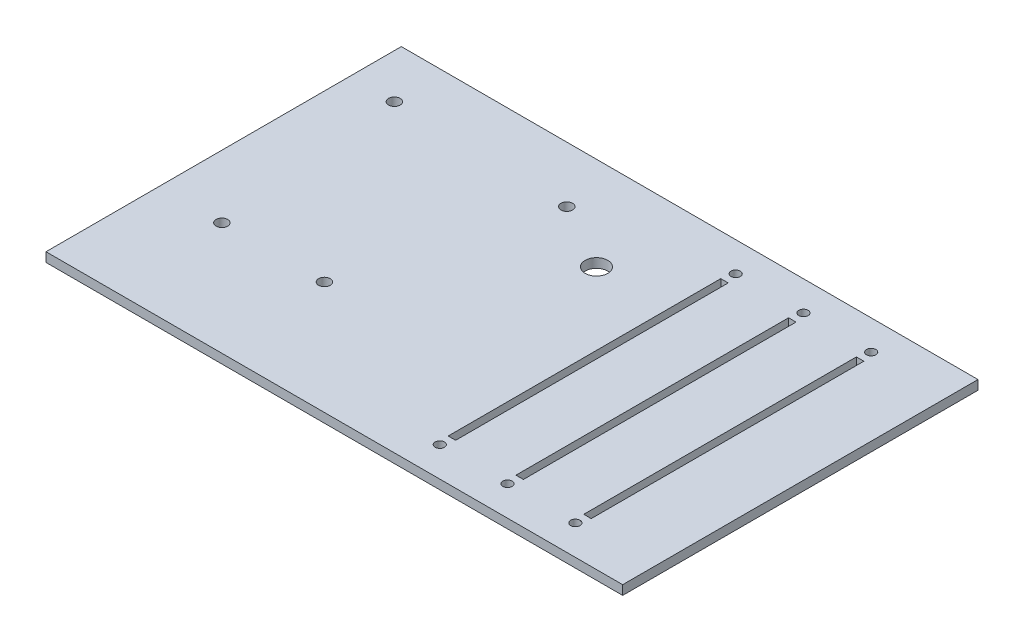
ISO-10303-21;
HEADER;
FILE_DESCRIPTION(('STEP AP214'),'2;1');
FILE_NAME('part.step','',(''),(''),'','','');
FILE_SCHEMA(('AUTOMOTIVE_DESIGN { 1 0 10303 214 1 1 1 1 }'));
ENDSEC;
DATA;
#1=APPLICATION_CONTEXT('core data for automotive mechanical design processes');
#2=APPLICATION_PROTOCOL_DEFINITION('international standard','automotive_design',2000,#1);
#3=PRODUCT_CONTEXT('',#1,'mechanical');
#4=PRODUCT('Part','Part','',(#3));
#5=PRODUCT_RELATED_PRODUCT_CATEGORY('part','',(#4));
#6=PRODUCT_DEFINITION_FORMATION('','',#4);
#7=PRODUCT_DEFINITION_CONTEXT('part definition',#1,'design');
#8=PRODUCT_DEFINITION('design','',#6,#7);
#9=PRODUCT_DEFINITION_SHAPE('','',#8);
#10=(LENGTH_UNIT() NAMED_UNIT(*) SI_UNIT(.MILLI.,.METRE.));
#11=(NAMED_UNIT(*) PLANE_ANGLE_UNIT() SI_UNIT($,.RADIAN.));
#12=(NAMED_UNIT(*) SI_UNIT($,.STERADIAN.) SOLID_ANGLE_UNIT());
#13=UNCERTAINTY_MEASURE_WITH_UNIT(LENGTH_MEASURE(1.E-05),#10,'distance_accuracy_value','');
#14=(GEOMETRIC_REPRESENTATION_CONTEXT(3) GLOBAL_UNCERTAINTY_ASSIGNED_CONTEXT((#13)) GLOBAL_UNIT_ASSIGNED_CONTEXT((#10,
#11,#12)) REPRESENTATION_CONTEXT('',''));
#15=CARTESIAN_POINT('',(0.,0.,0.));
#16=DIRECTION('',(0.,0.,1.));
#17=DIRECTION('',(1.,0.,0.));
#18=AXIS2_PLACEMENT_3D('',#15,#16,#17);
#19=CARTESIAN_POINT('',(0.,2.54,0.));
#20=DIRECTION('',(0.,-1.,0.));
#21=DIRECTION('',(0.,0.,-1.));
#22=AXIS2_PLACEMENT_3D('',#19,#20,#21);
#23=PLANE('',#22);
#24=DIRECTION('',(-1.,0.,0.));
#25=VECTOR('',#24,1.);
#26=CARTESIAN_POINT('',(38.19525,2.54,-37.17925));
#27=LINE('',#26,#25);
#28=CARTESIAN_POINT('',(40.22725,2.54,-37.17925));
#29=VERTEX_POINT('',#28);
#30=CARTESIAN_POINT('',(38.19525,2.54,-37.17925));
#31=VERTEX_POINT('',#30);
#32=EDGE_CURVE('E185',#29,#31,#27,.T.);
#33=ORIENTED_EDGE('',*,*,#32,.F.);
#34=DIRECTION('',(0.,0.,-1.));
#35=VECTOR('',#34,1.);
#36=CARTESIAN_POINT('',(40.22725,2.54,-37.17925));
#37=LINE('',#36,#35);
#38=CARTESIAN_POINT('',(40.22725,2.54,37.11575));
#39=VERTEX_POINT('',#38);
#40=EDGE_CURVE('E193',#39,#29,#37,.T.);
#41=ORIENTED_EDGE('',*,*,#40,.F.);
#42=DIRECTION('',(1.,0.,0.));
#43=VECTOR('',#42,1.);
#44=CARTESIAN_POINT('',(40.22725,2.54,37.11575));
#45=LINE('',#44,#43);
#46=CARTESIAN_POINT('',(38.19525,2.54,37.11575));
#47=VERTEX_POINT('',#46);
#48=EDGE_CURVE('E190',#47,#39,#45,.T.);
#49=ORIENTED_EDGE('',*,*,#48,.F.);
#50=DIRECTION('',(0.,0.,1.));
#51=VECTOR('',#50,1.);
#52=CARTESIAN_POINT('',(38.19525,2.54,37.11575));
#53=LINE('',#52,#51);
#54=EDGE_CURVE('E187',#31,#47,#53,.T.);
#55=ORIENTED_EDGE('',*,*,#54,.F.);
#56=EDGE_LOOP('',(#33,#41,#49,#55));
#57=FACE_BOUND('',#56,.T.);
#58=CARTESIAN_POINT('',(-18.25625,2.54,-33.17875));
#59=DIRECTION('',(0.,1.,0.));
#60=DIRECTION('',(0.,0.,1.));
#61=AXIS2_PLACEMENT_3D('',#58,#59,#60);
#62=CIRCLE('',#61,1.5875);
#63=CARTESIAN_POINT('',(-18.25625,2.54,-31.59125));
#64=VERTEX_POINT('',#63);
#65=EDGE_CURVE('E247',#64,#64,#62,.T.);
#66=ORIENTED_EDGE('',*,*,#65,.F.);
#67=EDGE_LOOP('',(#66));
#68=FACE_BOUND('',#67,.T.);
#69=CARTESIAN_POINT('',(-33.49625,2.54,17.62125));
#70=DIRECTION('',(0.,1.,0.));
#71=DIRECTION('',(0.,0.,1.));
#72=AXIS2_PLACEMENT_3D('',#69,#70,#71);
#73=CIRCLE('',#72,1.5875);
#74=CARTESIAN_POINT('',(-33.49625,2.54,19.20875));
#75=VERTEX_POINT('',#74);
#76=EDGE_CURVE('E253',#75,#75,#73,.T.);
#77=ORIENTED_EDGE('',*,*,#76,.F.);
#78=EDGE_LOOP('',(#77));
#79=FACE_BOUND('',#78,.T.);
#80=CARTESIAN_POINT('',(-61.43625,2.54,17.62125));
#81=DIRECTION('',(0.,1.,0.));
#82=DIRECTION('',(0.,0.,1.));
#83=AXIS2_PLACEMENT_3D('',#80,#81,#82);
#84=CIRCLE('',#83,1.5875);
#85=CARTESIAN_POINT('',(-61.43625,2.54,19.20875));
#86=VERTEX_POINT('',#85);
#87=EDGE_CURVE('E259',#86,#86,#84,.T.);
#88=ORIENTED_EDGE('',*,*,#87,.F.);
#89=EDGE_LOOP('',(#88));
#90=FACE_BOUND('',#89,.T.);
#91=CARTESIAN_POINT('',(-66.51625,2.54,-34.44875));
#92=DIRECTION('',(0.,1.,0.));
#93=DIRECTION('',(0.,0.,1.));
#94=AXIS2_PLACEMENT_3D('',#91,#92,#93);
#95=CIRCLE('',#94,1.5875);
#96=CARTESIAN_POINT('',(-66.51625,2.54,-32.86125));
#97=VERTEX_POINT('',#96);
#98=EDGE_CURVE('E265',#97,#97,#95,.T.);
#99=ORIENTED_EDGE('',*,*,#98,.F.);
#100=EDGE_LOOP('',(#99));
#101=FACE_BOUND('',#100,.T.);
#102=DIRECTION('',(0.,0.,-1.));
#103=VECTOR('',#102,1.);
#104=CARTESIAN_POINT('',(78.58125,2.54,48.41875));
#105=LINE('',#104,#103);
#106=CARTESIAN_POINT('',(78.58125,2.54,48.41875));
#107=VERTEX_POINT('',#106);
#108=CARTESIAN_POINT('',(78.58125,2.54,-48.41875));
#109=VERTEX_POINT('',#108);
#110=EDGE_CURVE('E271',#107,#109,#105,.T.);
#111=ORIENTED_EDGE('',*,*,#110,.T.);
#112=DIRECTION('',(-1.,0.,0.));
#113=VECTOR('',#112,1.);
#114=CARTESIAN_POINT('',(-78.58125,2.54,-48.41875));
#115=LINE('',#114,#113);
#116=CARTESIAN_POINT('',(-78.58125,2.54,-48.41875));
#117=VERTEX_POINT('',#116);
#118=EDGE_CURVE('E274',#109,#117,#115,.T.);
#119=ORIENTED_EDGE('',*,*,#118,.T.);
#120=DIRECTION('',(0.,0.,1.));
#121=VECTOR('',#120,1.);
#122=CARTESIAN_POINT('',(-78.58125,2.54,48.41875));
#123=LINE('',#122,#121);
#124=CARTESIAN_POINT('',(-78.58125,2.54,48.41875));
#125=VERTEX_POINT('',#124);
#126=EDGE_CURVE('E277',#117,#125,#123,.T.);
#127=ORIENTED_EDGE('',*,*,#126,.T.);
#128=DIRECTION('',(1.,0.,0.));
#129=VECTOR('',#128,1.);
#130=CARTESIAN_POINT('',(-78.58125,2.54,48.41875));
#131=LINE('',#130,#129);
#132=EDGE_CURVE('E279',#125,#107,#131,.T.);
#133=ORIENTED_EDGE('',*,*,#132,.T.);
#134=EDGE_LOOP('',(#111,#119,#127,#133));
#135=FACE_BOUND('',#134,.T.);
#136=DIRECTION('',(-1.,0.,0.));
#137=VECTOR('',#136,1.);
#138=CARTESIAN_POINT('',(19.7167499999999,2.54,-37.17925));
#139=LINE('',#138,#137);
#140=CARTESIAN_POINT('',(21.74875,2.54,-37.17925));
#141=VERTEX_POINT('',#140);
#142=CARTESIAN_POINT('',(19.7167499999999,2.54,-37.17925));
#143=VERTEX_POINT('',#142);
#144=EDGE_CURVE('E216',#141,#143,#139,.T.);
#145=ORIENTED_EDGE('',*,*,#144,.F.);
#146=DIRECTION('',(0.,0.,-1.));
#147=VECTOR('',#146,1.);
#148=CARTESIAN_POINT('',(21.74875,2.54,-37.17925));
#149=LINE('',#148,#147);
#150=CARTESIAN_POINT('',(21.74875,2.54,37.11575));
#151=VERTEX_POINT('',#150);
#152=EDGE_CURVE('E224',#151,#141,#149,.T.);
#153=ORIENTED_EDGE('',*,*,#152,.F.);
#154=DIRECTION('',(1.,0.,0.));
#155=VECTOR('',#154,1.);
#156=CARTESIAN_POINT('',(21.74875,2.54,37.11575));
#157=LINE('',#156,#155);
#158=CARTESIAN_POINT('',(19.7167499999999,2.54,37.11575));
#159=VERTEX_POINT('',#158);
#160=EDGE_CURVE('E221',#159,#151,#157,.T.);
#161=ORIENTED_EDGE('',*,*,#160,.F.);
#162=DIRECTION('',(0.,0.,1.));
#163=VECTOR('',#162,1.);
#164=CARTESIAN_POINT('',(19.7167499999999,2.54,37.11575));
#165=LINE('',#164,#163);
#166=EDGE_CURVE('E218',#143,#159,#165,.T.);
#167=ORIENTED_EDGE('',*,*,#166,.F.);
#168=EDGE_LOOP('',(#145,#153,#161,#167));
#169=FACE_BOUND('',#168,.T.);
#170=DIRECTION('',(-1.,0.,0.));
#171=VECTOR('',#170,1.);
#172=CARTESIAN_POINT('',(56.67375,2.54,-37.17925));
#173=LINE('',#172,#171);
#174=CARTESIAN_POINT('',(58.70575,2.54,-37.17925));
#175=VERTEX_POINT('',#174);
#176=CARTESIAN_POINT('',(56.67375,2.54,-37.17925));
#177=VERTEX_POINT('',#176);
#178=EDGE_CURVE('E146',#175,#177,#173,.T.);
#179=ORIENTED_EDGE('',*,*,#178,.F.);
#180=DIRECTION('',(0.,0.,-1.));
#181=VECTOR('',#180,1.);
#182=CARTESIAN_POINT('',(58.70575,2.54,-37.17925));
#183=LINE('',#182,#181);
#184=CARTESIAN_POINT('',(58.70575,2.54,37.11575));
#185=VERTEX_POINT('',#184);
#186=EDGE_CURVE('E169',#185,#175,#183,.T.);
#187=ORIENTED_EDGE('',*,*,#186,.F.);
#188=DIRECTION('',(1.,0.,0.));
#189=VECTOR('',#188,1.);
#190=CARTESIAN_POINT('',(58.70575,2.54,37.11575));
#191=LINE('',#190,#189);
#192=CARTESIAN_POINT('',(56.67375,2.54,37.11575));
#193=VERTEX_POINT('',#192);
#194=EDGE_CURVE('E167',#193,#185,#191,.T.);
#195=ORIENTED_EDGE('',*,*,#194,.F.);
#196=DIRECTION('',(0.,0.,1.));
#197=VECTOR('',#196,1.);
#198=CARTESIAN_POINT('',(56.67375,2.54,37.11575));
#199=LINE('',#198,#197);
#200=EDGE_CURVE('E154',#177,#193,#199,.T.);
#201=ORIENTED_EDGE('',*,*,#200,.F.);
#202=EDGE_LOOP('',(#179,#187,#195,#201));
#203=FACE_BOUND('',#202,.T.);
#204=CARTESIAN_POINT('',(57.56275,2.54,-40.32885));
#205=DIRECTION('',(0.,1.,0.));
#206=DIRECTION('',(0.,0.,1.));
#207=AXIS2_PLACEMENT_3D('',#204,#205,#206);
#208=CIRCLE('',#207,1.27);
#209=CARTESIAN_POINT('',(57.56275,2.54,-39.05885));
#210=VERTEX_POINT('',#209);
#211=EDGE_CURVE('E175',#210,#210,#208,.T.);
#212=ORIENTED_EDGE('',*,*,#211,.F.);
#213=EDGE_LOOP('',(#212));
#214=FACE_BOUND('',#213,.T.);
#215=CARTESIAN_POINT('',(39.08425,2.54,-40.35425));
#216=DIRECTION('',(0.,1.,0.));
#217=DIRECTION('',(0.,0.,1.));
#218=AXIS2_PLACEMENT_3D('',#215,#216,#217);
#219=CIRCLE('',#218,1.27);
#220=CARTESIAN_POINT('',(39.08425,2.54,-39.08425));
#221=VERTEX_POINT('',#220);
#222=EDGE_CURVE('E395',#221,#221,#219,.T.);
#223=ORIENTED_EDGE('',*,*,#222,.F.);
#224=EDGE_LOOP('',(#223));
#225=FACE_BOUND('',#224,.T.);
#226=CARTESIAN_POINT('',(20.6057499999999,2.54,-40.35425));
#227=DIRECTION('',(0.,1.,0.));
#228=DIRECTION('',(0.,0.,1.));
#229=AXIS2_PLACEMENT_3D('',#226,#227,#228);
#230=CIRCLE('',#229,1.27);
#231=CARTESIAN_POINT('',(20.6057499999999,2.54,-39.08425));
#232=VERTEX_POINT('',#231);
#233=EDGE_CURVE('E390',#232,#232,#230,.T.);
#234=ORIENTED_EDGE('',*,*,#233,.F.);
#235=EDGE_LOOP('',(#234));
#236=FACE_BOUND('',#235,.T.);
#237=CARTESIAN_POINT('',(57.56275,2.54,40.29075));
#238=DIRECTION('',(0.,1.,0.));
#239=DIRECTION('',(0.,0.,1.));
#240=AXIS2_PLACEMENT_3D('',#237,#238,#239);
#241=CIRCLE('',#240,1.27);
#242=CARTESIAN_POINT('',(57.56275,2.54,41.56075));
#243=VERTEX_POINT('',#242);
#244=EDGE_CURVE('E385',#243,#243,#241,.T.);
#245=ORIENTED_EDGE('',*,*,#244,.F.);
#246=EDGE_LOOP('',(#245));
#247=FACE_BOUND('',#246,.T.);
#248=CARTESIAN_POINT('',(39.08425,2.54,40.29075));
#249=DIRECTION('',(0.,1.,0.));
#250=DIRECTION('',(0.,0.,1.));
#251=AXIS2_PLACEMENT_3D('',#248,#249,#250);
#252=CIRCLE('',#251,1.27);
#253=CARTESIAN_POINT('',(39.08425,2.54,41.56075));
#254=VERTEX_POINT('',#253);
#255=EDGE_CURVE('E380',#254,#254,#252,.T.);
#256=ORIENTED_EDGE('',*,*,#255,.F.);
#257=EDGE_LOOP('',(#256));
#258=FACE_BOUND('',#257,.T.);
#259=CARTESIAN_POINT('',(20.6057499999999,2.54,40.29075));
#260=DIRECTION('',(0.,1.,0.));
#261=DIRECTION('',(0.,0.,1.));
#262=AXIS2_PLACEMENT_3D('',#259,#260,#261);
#263=CIRCLE('',#262,1.27);
#264=CARTESIAN_POINT('',(20.6057499999999,2.54,41.56075));
#265=VERTEX_POINT('',#264);
#266=EDGE_CURVE('E375',#265,#265,#263,.T.);
#267=ORIENTED_EDGE('',*,*,#266,.F.);
#268=EDGE_LOOP('',(#267));
#269=FACE_BOUND('',#268,.T.);
#270=CARTESIAN_POINT('',(0.,2.54,-23.01875));
#271=DIRECTION('',(0.,1.,0.));
#272=DIRECTION('',(0.,0.,1.));
#273=AXIS2_PLACEMENT_3D('',#270,#271,#272);
#274=CIRCLE('',#273,3.0861);
#275=CARTESIAN_POINT('',(0.,2.54,-19.93265));
#276=VERTEX_POINT('',#275);
#277=EDGE_CURVE('E369',#276,#276,#274,.T.);
#278=ORIENTED_EDGE('',*,*,#277,.F.);
#279=EDGE_LOOP('',(#278));
#280=FACE_BOUND('',#279,.T.);
#281=ADVANCED_FACE('F33',(#57,#68,#79,#90,#101,#135,#169,#203,#214,#225,#236,#247,#258,#269,
#280),#23,.F.);
#282=CARTESIAN_POINT('',(0.,0.,0.));
#283=DIRECTION('',(0.,-1.,0.));
#284=DIRECTION('',(0.,0.,-1.));
#285=AXIS2_PLACEMENT_3D('',#282,#283,#284);
#286=PLANE('',#285);
#287=CARTESIAN_POINT('',(20.6057499999999,0.,40.29075));
#288=DIRECTION('',(0.,1.,0.));
#289=DIRECTION('',(0.,0.,1.));
#290=AXIS2_PLACEMENT_3D('',#287,#288,#289);
#291=CIRCLE('',#290,1.27);
#292=CARTESIAN_POINT('',(20.6057499999999,0.,41.56075));
#293=VERTEX_POINT('',#292);
#294=EDGE_CURVE('E372',#293,#293,#291,.T.);
#295=ORIENTED_EDGE('',*,*,#294,.T.);
#296=EDGE_LOOP('',(#295));
#297=FACE_BOUND('',#296,.T.);
#298=CARTESIAN_POINT('',(57.56275,0.,40.29075));
#299=DIRECTION('',(0.,1.,0.));
#300=DIRECTION('',(0.,0.,1.));
#301=AXIS2_PLACEMENT_3D('',#298,#299,#300);
#302=CIRCLE('',#301,1.27);
#303=CARTESIAN_POINT('',(57.56275,0.,41.56075));
#304=VERTEX_POINT('',#303);
#305=EDGE_CURVE('E383',#304,#304,#302,.T.);
#306=ORIENTED_EDGE('',*,*,#305,.T.);
#307=EDGE_LOOP('',(#306));
#308=FACE_BOUND('',#307,.T.);
#309=CARTESIAN_POINT('',(39.08425,0.,-40.35425));
#310=DIRECTION('',(0.,1.,0.));
#311=DIRECTION('',(0.,0.,1.));
#312=AXIS2_PLACEMENT_3D('',#309,#310,#311);
#313=CIRCLE('',#312,1.27);
#314=CARTESIAN_POINT('',(39.08425,0.,-39.08425));
#315=VERTEX_POINT('',#314);
#316=EDGE_CURVE('E393',#315,#315,#313,.T.);
#317=ORIENTED_EDGE('',*,*,#316,.T.);
#318=EDGE_LOOP('',(#317));
#319=FACE_BOUND('',#318,.T.);
#320=DIRECTION('',(0.,0.,-1.));
#321=VECTOR('',#320,1.);
#322=CARTESIAN_POINT('',(58.70575,0.,-37.17925));
#323=LINE('',#322,#321);
#324=CARTESIAN_POINT('',(58.70575,0.,37.11575));
#325=VERTEX_POINT('',#324);
#326=CARTESIAN_POINT('',(58.70575,0.,-37.17925));
#327=VERTEX_POINT('',#326);
#328=EDGE_CURVE('E155',#325,#327,#323,.T.);
#329=ORIENTED_EDGE('',*,*,#328,.T.);
#330=DIRECTION('',(-1.,0.,0.));
#331=VECTOR('',#330,1.);
#332=CARTESIAN_POINT('',(56.67375,0.,-37.17925));
#333=LINE('',#332,#331);
#334=CARTESIAN_POINT('',(56.67375,0.,-37.17925));
#335=VERTEX_POINT('',#334);
#336=EDGE_CURVE('E56',#327,#335,#333,.T.);
#337=ORIENTED_EDGE('',*,*,#336,.T.);
#338=DIRECTION('',(0.,0.,1.));
#339=VECTOR('',#338,1.);
#340=CARTESIAN_POINT('',(56.67375,0.,37.11575));
#341=LINE('',#340,#339);
#342=CARTESIAN_POINT('',(56.67375,0.,37.11575));
#343=VERTEX_POINT('',#342);
#344=EDGE_CURVE('E161',#335,#343,#341,.T.);
#345=ORIENTED_EDGE('',*,*,#344,.T.);
#346=DIRECTION('',(1.,0.,0.));
#347=VECTOR('',#346,1.);
#348=CARTESIAN_POINT('',(58.70575,0.,37.11575));
#349=LINE('',#348,#347);
#350=EDGE_CURVE('E177',#343,#325,#349,.T.);
#351=ORIENTED_EDGE('',*,*,#350,.T.);
#352=EDGE_LOOP('',(#329,#337,#345,#351));
#353=FACE_BOUND('',#352,.T.);
#354=DIRECTION('',(0.,0.,-1.));
#355=VECTOR('',#354,1.);
#356=CARTESIAN_POINT('',(40.22725,0.,-37.17925));
#357=LINE('',#356,#355);
#358=CARTESIAN_POINT('',(40.22725,0.,37.11575));
#359=VERTEX_POINT('',#358);
#360=CARTESIAN_POINT('',(40.22725,0.,-37.17925));
#361=VERTEX_POINT('',#360);
#362=EDGE_CURVE('E188',#359,#361,#357,.T.);
#363=ORIENTED_EDGE('',*,*,#362,.T.);
#364=DIRECTION('',(-1.,0.,0.));
#365=VECTOR('',#364,1.);
#366=CARTESIAN_POINT('',(38.19525,0.,-37.17925));
#367=LINE('',#366,#365);
#368=CARTESIAN_POINT('',(38.19525,0.,-37.17925));
#369=VERTEX_POINT('',#368);
#370=EDGE_CURVE('E162',#361,#369,#367,.T.);
#371=ORIENTED_EDGE('',*,*,#370,.T.);
#372=DIRECTION('',(0.,0.,1.));
#373=VECTOR('',#372,1.);
#374=CARTESIAN_POINT('',(38.19525,0.,37.11575));
#375=LINE('',#374,#373);
#376=CARTESIAN_POINT('',(38.19525,0.,37.11575));
#377=VERTEX_POINT('',#376);
#378=EDGE_CURVE('E198',#369,#377,#375,.T.);
#379=ORIENTED_EDGE('',*,*,#378,.T.);
#380=DIRECTION('',(1.,0.,0.));
#381=VECTOR('',#380,1.);
#382=CARTESIAN_POINT('',(40.22725,0.,37.11575));
#383=LINE('',#382,#381);
#384=EDGE_CURVE('E201',#377,#359,#383,.T.);
#385=ORIENTED_EDGE('',*,*,#384,.T.);
#386=EDGE_LOOP('',(#363,#371,#379,#385));
#387=FACE_BOUND('',#386,.T.);
#388=DIRECTION('',(0.,0.,-1.));
#389=VECTOR('',#388,1.);
#390=CARTESIAN_POINT('',(21.74875,0.,-37.17925));
#391=LINE('',#390,#389);
#392=CARTESIAN_POINT('',(21.74875,0.,37.11575));
#393=VERTEX_POINT('',#392);
#394=CARTESIAN_POINT('',(21.74875,0.,-37.17925));
#395=VERTEX_POINT('',#394);
#396=EDGE_CURVE('E219',#393,#395,#391,.T.);
#397=ORIENTED_EDGE('',*,*,#396,.T.);
#398=DIRECTION('',(-1.,0.,0.));
#399=VECTOR('',#398,1.);
#400=CARTESIAN_POINT('',(19.7167499999999,0.,-37.17925));
#401=LINE('',#400,#399);
#402=CARTESIAN_POINT('',(19.7167499999999,0.,-37.17925));
#403=VERTEX_POINT('',#402);
#404=EDGE_CURVE('E215',#395,#403,#401,.T.);
#405=ORIENTED_EDGE('',*,*,#404,.T.);
#406=DIRECTION('',(0.,0.,1.));
#407=VECTOR('',#406,1.);
#408=CARTESIAN_POINT('',(19.7167499999999,0.,37.11575));
#409=LINE('',#408,#407);
#410=CARTESIAN_POINT('',(19.7167499999999,0.,37.11575));
#411=VERTEX_POINT('',#410);
#412=EDGE_CURVE('E229',#403,#411,#409,.T.);
#413=ORIENTED_EDGE('',*,*,#412,.T.);
#414=DIRECTION('',(1.,0.,0.));
#415=VECTOR('',#414,1.);
#416=CARTESIAN_POINT('',(21.74875,0.,37.11575));
#417=LINE('',#416,#415);
#418=EDGE_CURVE('E232',#411,#393,#417,.T.);
#419=ORIENTED_EDGE('',*,*,#418,.T.);
#420=EDGE_LOOP('',(#397,#405,#413,#419));
#421=FACE_BOUND('',#420,.T.);
#422=CARTESIAN_POINT('',(-18.25625,0.,-33.17875));
#423=DIRECTION('',(0.,1.,0.));
#424=DIRECTION('',(0.,0.,1.));
#425=AXIS2_PLACEMENT_3D('',#422,#423,#424);
#426=CIRCLE('',#425,1.5875);
#427=CARTESIAN_POINT('',(-18.25625,0.,-31.59125));
#428=VERTEX_POINT('',#427);
#429=EDGE_CURVE('E246',#428,#428,#426,.T.);
#430=ORIENTED_EDGE('',*,*,#429,.T.);
#431=EDGE_LOOP('',(#430));
#432=FACE_BOUND('',#431,.T.);
#433=CARTESIAN_POINT('',(-61.43625,0.,17.62125));
#434=DIRECTION('',(0.,1.,0.));
#435=DIRECTION('',(0.,0.,1.));
#436=AXIS2_PLACEMENT_3D('',#433,#434,#435);
#437=CIRCLE('',#436,1.5875);
#438=CARTESIAN_POINT('',(-61.43625,0.,19.20875));
#439=VERTEX_POINT('',#438);
#440=EDGE_CURVE('E256',#439,#439,#437,.T.);
#441=ORIENTED_EDGE('',*,*,#440,.T.);
#442=EDGE_LOOP('',(#441));
#443=FACE_BOUND('',#442,.T.);
#444=DIRECTION('',(0.,0.,-1.));
#445=VECTOR('',#444,1.);
#446=CARTESIAN_POINT('',(78.58125,0.,48.41875));
#447=LINE('',#446,#445);
#448=CARTESIAN_POINT('',(78.58125,0.,48.41875));
#449=VERTEX_POINT('',#448);
#450=CARTESIAN_POINT('',(78.58125,0.,-48.41875));
#451=VERTEX_POINT('',#450);
#452=EDGE_CURVE('E268',#449,#451,#447,.T.);
#453=ORIENTED_EDGE('',*,*,#452,.F.);
#454=DIRECTION('',(1.,0.,0.));
#455=VECTOR('',#454,1.);
#456=CARTESIAN_POINT('',(-78.58125,0.,48.41875));
#457=LINE('',#456,#455);
#458=CARTESIAN_POINT('',(-78.58125,0.,48.41875));
#459=VERTEX_POINT('',#458);
#460=EDGE_CURVE('E275',#459,#449,#457,.T.);
#461=ORIENTED_EDGE('',*,*,#460,.F.);
#462=DIRECTION('',(0.,0.,1.));
#463=VECTOR('',#462,1.);
#464=CARTESIAN_POINT('',(-78.58125,0.,48.41875));
#465=LINE('',#464,#463);
#466=CARTESIAN_POINT('',(-78.58125,0.,-48.41875));
#467=VERTEX_POINT('',#466);
#468=EDGE_CURVE('E286',#467,#459,#465,.T.);
#469=ORIENTED_EDGE('',*,*,#468,.F.);
#470=DIRECTION('',(-1.,0.,0.));
#471=VECTOR('',#470,1.);
#472=CARTESIAN_POINT('',(-78.58125,0.,-48.41875));
#473=LINE('',#472,#471);
#474=EDGE_CURVE('E284',#451,#467,#473,.T.);
#475=ORIENTED_EDGE('',*,*,#474,.F.);
#476=EDGE_LOOP('',(#453,#461,#469,#475));
#477=FACE_BOUND('',#476,.T.);
#478=CARTESIAN_POINT('',(-66.51625,0.,-34.44875));
#479=DIRECTION('',(0.,1.,0.));
#480=DIRECTION('',(0.,0.,1.));
#481=AXIS2_PLACEMENT_3D('',#478,#479,#480);
#482=CIRCLE('',#481,1.5875);
#483=CARTESIAN_POINT('',(-66.51625,0.,-32.86125));
#484=VERTEX_POINT('',#483);
#485=EDGE_CURVE('E262',#484,#484,#482,.T.);
#486=ORIENTED_EDGE('',*,*,#485,.T.);
#487=EDGE_LOOP('',(#486));
#488=FACE_BOUND('',#487,.T.);
#489=CARTESIAN_POINT('',(-33.49625,0.,17.62125));
#490=DIRECTION('',(0.,1.,0.));
#491=DIRECTION('',(0.,0.,1.));
#492=AXIS2_PLACEMENT_3D('',#489,#490,#491);
#493=CIRCLE('',#492,1.5875);
#494=CARTESIAN_POINT('',(-33.49625,0.,19.20875));
#495=VERTEX_POINT('',#494);
#496=EDGE_CURVE('E250',#495,#495,#493,.T.);
#497=ORIENTED_EDGE('',*,*,#496,.T.);
#498=EDGE_LOOP('',(#497));
#499=FACE_BOUND('',#498,.T.);
#500=CARTESIAN_POINT('',(57.56275,0.,-40.32885));
#501=DIRECTION('',(0.,1.,0.));
#502=DIRECTION('',(0.,0.,1.));
#503=AXIS2_PLACEMENT_3D('',#500,#501,#502);
#504=CIRCLE('',#503,1.27);
#505=CARTESIAN_POINT('',(57.56275,0.,-39.05885));
#506=VERTEX_POINT('',#505);
#507=EDGE_CURVE('E356',#506,#506,#504,.T.);
#508=ORIENTED_EDGE('',*,*,#507,.T.);
#509=EDGE_LOOP('',(#508));
#510=FACE_BOUND('',#509,.T.);
#511=CARTESIAN_POINT('',(20.6057499999999,0.,-40.35425));
#512=DIRECTION('',(0.,1.,0.));
#513=DIRECTION('',(0.,0.,1.));
#514=AXIS2_PLACEMENT_3D('',#511,#512,#513);
#515=CIRCLE('',#514,1.27);
#516=CARTESIAN_POINT('',(20.6057499999999,0.,-39.08425));
#517=VERTEX_POINT('',#516);
#518=EDGE_CURVE('E360',#517,#517,#515,.T.);
#519=ORIENTED_EDGE('',*,*,#518,.T.);
#520=EDGE_LOOP('',(#519));
#521=FACE_BOUND('',#520,.T.);
#522=CARTESIAN_POINT('',(39.08425,0.,40.29075));
#523=DIRECTION('',(0.,1.,0.));
#524=DIRECTION('',(0.,0.,1.));
#525=AXIS2_PLACEMENT_3D('',#522,#523,#524);
#526=CIRCLE('',#525,1.27);
#527=CARTESIAN_POINT('',(39.08425,0.,41.56075));
#528=VERTEX_POINT('',#527);
#529=EDGE_CURVE('E364',#528,#528,#526,.T.);
#530=ORIENTED_EDGE('',*,*,#529,.T.);
#531=EDGE_LOOP('',(#530));
#532=FACE_BOUND('',#531,.T.);
#533=CARTESIAN_POINT('',(0.,0.,-23.01875));
#534=DIRECTION('',(0.,1.,0.));
#535=DIRECTION('',(0.,0.,1.));
#536=AXIS2_PLACEMENT_3D('',#533,#534,#535);
#537=CIRCLE('',#536,3.0861);
#538=CARTESIAN_POINT('',(0.,0.,-19.93265));
#539=VERTEX_POINT('',#538);
#540=EDGE_CURVE('E367',#539,#539,#537,.T.);
#541=ORIENTED_EDGE('',*,*,#540,.T.);
#542=EDGE_LOOP('',(#541));
#543=FACE_BOUND('',#542,.T.);
#544=ADVANCED_FACE('F304',(#297,#308,#319,#353,#387,#421,#432,#443,#477,#488,#499,#510,#521,
#532,#543),#286,.T.);
#545=CARTESIAN_POINT('',(78.58125,2.54,48.41875));
#546=DIRECTION('',(-1.,0.,0.));
#547=DIRECTION('',(0.,0.,1.));
#548=AXIS2_PLACEMENT_3D('',#545,#546,#547);
#549=PLANE('',#548);
#550=ORIENTED_EDGE('',*,*,#452,.T.);
#551=DIRECTION('',(0.,-1.,0.));
#552=VECTOR('',#551,1.);
#553=CARTESIAN_POINT('',(78.58125,2.54,-48.41875));
#554=LINE('',#553,#552);
#555=EDGE_CURVE('E11',#109,#451,#554,.T.);
#556=ORIENTED_EDGE('',*,*,#555,.F.);
#557=ORIENTED_EDGE('',*,*,#110,.F.);
#558=DIRECTION('',(0.,-1.,0.));
#559=VECTOR('',#558,1.);
#560=CARTESIAN_POINT('',(78.58125,2.54,48.41875));
#561=LINE('',#560,#559);
#562=EDGE_CURVE('E281',#107,#449,#561,.T.);
#563=ORIENTED_EDGE('',*,*,#562,.T.);
#564=EDGE_LOOP('',(#550,#556,#557,#563));
#565=FACE_BOUND('',#564,.T.);
#566=ADVANCED_FACE('F35',(#565),#549,.F.);
#567=CARTESIAN_POINT('',(-78.58125,2.54,-48.41875));
#568=DIRECTION('',(0.,0.,1.));
#569=DIRECTION('',(1.,0.,0.));
#570=AXIS2_PLACEMENT_3D('',#567,#568,#569);
#571=PLANE('',#570);
#572=ORIENTED_EDGE('',*,*,#474,.T.);
#573=DIRECTION('',(0.,-1.,0.));
#574=VECTOR('',#573,1.);
#575=CARTESIAN_POINT('',(-78.58125,2.54,-48.41875));
#576=LINE('',#575,#574);
#577=EDGE_CURVE('E41',#117,#467,#576,.T.);
#578=ORIENTED_EDGE('',*,*,#577,.F.);
#579=ORIENTED_EDGE('',*,*,#118,.F.);
#580=ORIENTED_EDGE('',*,*,#555,.T.);
#581=EDGE_LOOP('',(#572,#578,#579,#580));
#582=FACE_BOUND('',#581,.T.);
#583=ADVANCED_FACE('F315',(#582),#571,.F.);
#584=CARTESIAN_POINT('',(-78.58125,2.54,48.41875));
#585=DIRECTION('',(1.,0.,0.));
#586=DIRECTION('',(0.,0.,-1.));
#587=AXIS2_PLACEMENT_3D('',#584,#585,#586);
#588=PLANE('',#587);
#589=ORIENTED_EDGE('',*,*,#468,.T.);
#590=DIRECTION('',(0.,-1.,0.));
#591=VECTOR('',#590,1.);
#592=CARTESIAN_POINT('',(-78.58125,2.54,48.41875));
#593=LINE('',#592,#591);
#594=EDGE_CURVE('E291',#125,#459,#593,.T.);
#595=ORIENTED_EDGE('',*,*,#594,.F.);
#596=ORIENTED_EDGE('',*,*,#126,.F.);
#597=ORIENTED_EDGE('',*,*,#577,.T.);
#598=EDGE_LOOP('',(#589,#595,#596,#597));
#599=FACE_BOUND('',#598,.T.);
#600=ADVANCED_FACE('F298',(#599),#588,.F.);
#601=CARTESIAN_POINT('',(-78.58125,2.54,48.41875));
#602=DIRECTION('',(0.,0.,-1.));
#603=DIRECTION('',(-1.,0.,0.));
#604=AXIS2_PLACEMENT_3D('',#601,#602,#603);
#605=PLANE('',#604);
#606=ORIENTED_EDGE('',*,*,#460,.T.);
#607=ORIENTED_EDGE('',*,*,#562,.F.);
#608=ORIENTED_EDGE('',*,*,#132,.F.);
#609=ORIENTED_EDGE('',*,*,#594,.T.);
#610=EDGE_LOOP('',(#606,#607,#608,#609));
#611=FACE_BOUND('',#610,.T.);
#612=ADVANCED_FACE('F308',(#611),#605,.F.);
#613=CARTESIAN_POINT('',(-66.51625,2.54,-34.44875));
#614=DIRECTION('',(0.,-1.,0.));
#615=DIRECTION('',(0.,0.,-1.));
#616=AXIS2_PLACEMENT_3D('',#613,#614,#615);
#617=CYLINDRICAL_SURFACE('',#616,1.5875);
#618=ORIENTED_EDGE('',*,*,#98,.T.);
#619=EDGE_LOOP('',(#618));
#620=FACE_BOUND('',#619,.T.);
#621=ORIENTED_EDGE('',*,*,#485,.F.);
#622=EDGE_LOOP('',(#621));
#623=FACE_BOUND('',#622,.T.);
#624=ADVANCED_FACE('F333',(#620,#623),#617,.F.);
#625=CARTESIAN_POINT('',(-61.43625,2.54,17.62125));
#626=DIRECTION('',(0.,-1.,0.));
#627=DIRECTION('',(0.,0.,-1.));
#628=AXIS2_PLACEMENT_3D('',#625,#626,#627);
#629=CYLINDRICAL_SURFACE('',#628,1.5875);
#630=ORIENTED_EDGE('',*,*,#87,.T.);
#631=EDGE_LOOP('',(#630));
#632=FACE_BOUND('',#631,.T.);
#633=ORIENTED_EDGE('',*,*,#440,.F.);
#634=EDGE_LOOP('',(#633));
#635=FACE_BOUND('',#634,.T.);
#636=ADVANCED_FACE('F340',(#632,#635),#629,.F.);
#637=CARTESIAN_POINT('',(-33.49625,2.54,17.62125));
#638=DIRECTION('',(0.,-1.,0.));
#639=DIRECTION('',(0.,0.,-1.));
#640=AXIS2_PLACEMENT_3D('',#637,#638,#639);
#641=CYLINDRICAL_SURFACE('',#640,1.5875);
#642=ORIENTED_EDGE('',*,*,#76,.T.);
#643=EDGE_LOOP('',(#642));
#644=FACE_BOUND('',#643,.T.);
#645=ORIENTED_EDGE('',*,*,#496,.F.);
#646=EDGE_LOOP('',(#645));
#647=FACE_BOUND('',#646,.T.);
#648=ADVANCED_FACE('F345',(#644,#647),#641,.F.);
#649=CARTESIAN_POINT('',(-18.25625,2.54,-33.17875));
#650=DIRECTION('',(0.,-1.,0.));
#651=DIRECTION('',(0.,0.,-1.));
#652=AXIS2_PLACEMENT_3D('',#649,#650,#651);
#653=CYLINDRICAL_SURFACE('',#652,1.5875);
#654=ORIENTED_EDGE('',*,*,#65,.T.);
#655=EDGE_LOOP('',(#654));
#656=FACE_BOUND('',#655,.T.);
#657=ORIENTED_EDGE('',*,*,#429,.F.);
#658=EDGE_LOOP('',(#657));
#659=FACE_BOUND('',#658,.T.);
#660=ADVANCED_FACE('F488',(#656,#659),#653,.F.);
#661=CARTESIAN_POINT('',(19.7167499999999,2.54,-37.17925));
#662=DIRECTION('',(0.,0.,1.));
#663=DIRECTION('',(1.,0.,0.));
#664=AXIS2_PLACEMENT_3D('',#661,#662,#663);
#665=PLANE('',#664);
#666=ORIENTED_EDGE('',*,*,#404,.F.);
#667=DIRECTION('',(0.,-1.,0.));
#668=VECTOR('',#667,1.);
#669=CARTESIAN_POINT('',(21.74875,2.54,-37.17925));
#670=LINE('',#669,#668);
#671=EDGE_CURVE('E226',#141,#395,#670,.T.);
#672=ORIENTED_EDGE('',*,*,#671,.F.);
#673=ORIENTED_EDGE('',*,*,#144,.T.);
#674=DIRECTION('',(0.,-1.,0.));
#675=VECTOR('',#674,1.);
#676=CARTESIAN_POINT('',(19.7167499999999,2.54,-37.17925));
#677=LINE('',#676,#675);
#678=EDGE_CURVE('E243',#143,#403,#677,.T.);
#679=ORIENTED_EDGE('',*,*,#678,.T.);
#680=EDGE_LOOP('',(#666,#672,#673,#679));
#681=FACE_BOUND('',#680,.T.);
#682=ADVANCED_FACE('F484',(#681),#665,.T.);
#683=CARTESIAN_POINT('',(19.7167499999999,2.54,37.11575));
#684=DIRECTION('',(1.,0.,0.));
#685=DIRECTION('',(0.,0.,-1.));
#686=AXIS2_PLACEMENT_3D('',#683,#684,#685);
#687=PLANE('',#686);
#688=ORIENTED_EDGE('',*,*,#412,.F.);
#689=ORIENTED_EDGE('',*,*,#678,.F.);
#690=ORIENTED_EDGE('',*,*,#166,.T.);
#691=DIRECTION('',(0.,-1.,0.));
#692=VECTOR('',#691,1.);
#693=CARTESIAN_POINT('',(19.7167499999999,2.54,37.11575));
#694=LINE('',#693,#692);
#695=EDGE_CURVE('E241',#159,#411,#694,.T.);
#696=ORIENTED_EDGE('',*,*,#695,.T.);
#697=EDGE_LOOP('',(#688,#689,#690,#696));
#698=FACE_BOUND('',#697,.T.);
#699=ADVANCED_FACE('F480',(#698),#687,.T.);
#700=CARTESIAN_POINT('',(21.74875,2.54,37.11575));
#701=DIRECTION('',(0.,0.,-1.));
#702=DIRECTION('',(-1.,0.,0.));
#703=AXIS2_PLACEMENT_3D('',#700,#701,#702);
#704=PLANE('',#703);
#705=ORIENTED_EDGE('',*,*,#418,.F.);
#706=ORIENTED_EDGE('',*,*,#695,.F.);
#707=ORIENTED_EDGE('',*,*,#160,.T.);
#708=DIRECTION('',(0.,-1.,0.));
#709=VECTOR('',#708,1.);
#710=CARTESIAN_POINT('',(21.74875,2.54,37.11575));
#711=LINE('',#710,#709);
#712=EDGE_CURVE('E239',#151,#393,#711,.T.);
#713=ORIENTED_EDGE('',*,*,#712,.T.);
#714=EDGE_LOOP('',(#705,#706,#707,#713));
#715=FACE_BOUND('',#714,.T.);
#716=ADVANCED_FACE('F476',(#715),#704,.T.);
#717=CARTESIAN_POINT('',(21.74875,2.54,-37.17925));
#718=DIRECTION('',(-1.,0.,0.));
#719=DIRECTION('',(0.,0.,1.));
#720=AXIS2_PLACEMENT_3D('',#717,#718,#719);
#721=PLANE('',#720);
#722=ORIENTED_EDGE('',*,*,#396,.F.);
#723=ORIENTED_EDGE('',*,*,#712,.F.);
#724=ORIENTED_EDGE('',*,*,#152,.T.);
#725=ORIENTED_EDGE('',*,*,#671,.T.);
#726=EDGE_LOOP('',(#722,#723,#724,#725));
#727=FACE_BOUND('',#726,.T.);
#728=ADVANCED_FACE('F472',(#727),#721,.T.);
#729=CARTESIAN_POINT('',(38.19525,2.54,-37.17925));
#730=DIRECTION('',(0.,0.,1.));
#731=DIRECTION('',(1.,0.,0.));
#732=AXIS2_PLACEMENT_3D('',#729,#730,#731);
#733=PLANE('',#732);
#734=ORIENTED_EDGE('',*,*,#370,.F.);
#735=DIRECTION('',(0.,-1.,0.));
#736=VECTOR('',#735,1.);
#737=CARTESIAN_POINT('',(40.22725,2.54,-37.17925));
#738=LINE('',#737,#736);
#739=EDGE_CURVE('E195',#29,#361,#738,.T.);
#740=ORIENTED_EDGE('',*,*,#739,.F.);
#741=ORIENTED_EDGE('',*,*,#32,.T.);
#742=DIRECTION('',(0.,-1.,0.));
#743=VECTOR('',#742,1.);
#744=CARTESIAN_POINT('',(38.19525,2.54,-37.17925));
#745=LINE('',#744,#743);
#746=EDGE_CURVE('E212',#31,#369,#745,.T.);
#747=ORIENTED_EDGE('',*,*,#746,.T.);
#748=EDGE_LOOP('',(#734,#740,#741,#747));
#749=FACE_BOUND('',#748,.T.);
#750=ADVANCED_FACE('F468',(#749),#733,.T.);
#751=CARTESIAN_POINT('',(38.19525,2.54,37.11575));
#752=DIRECTION('',(1.,0.,0.));
#753=DIRECTION('',(0.,0.,-1.));
#754=AXIS2_PLACEMENT_3D('',#751,#752,#753);
#755=PLANE('',#754);
#756=ORIENTED_EDGE('',*,*,#378,.F.);
#757=ORIENTED_EDGE('',*,*,#746,.F.);
#758=ORIENTED_EDGE('',*,*,#54,.T.);
#759=DIRECTION('',(0.,-1.,0.));
#760=VECTOR('',#759,1.);
#761=CARTESIAN_POINT('',(38.19525,2.54,37.11575));
#762=LINE('',#761,#760);
#763=EDGE_CURVE('E210',#47,#377,#762,.T.);
#764=ORIENTED_EDGE('',*,*,#763,.T.);
#765=EDGE_LOOP('',(#756,#757,#758,#764));
#766=FACE_BOUND('',#765,.T.);
#767=ADVANCED_FACE('F464',(#766),#755,.T.);
#768=CARTESIAN_POINT('',(40.22725,2.54,37.11575));
#769=DIRECTION('',(0.,0.,-1.));
#770=DIRECTION('',(-1.,0.,0.));
#771=AXIS2_PLACEMENT_3D('',#768,#769,#770);
#772=PLANE('',#771);
#773=ORIENTED_EDGE('',*,*,#384,.F.);
#774=ORIENTED_EDGE('',*,*,#763,.F.);
#775=ORIENTED_EDGE('',*,*,#48,.T.);
#776=DIRECTION('',(0.,-1.,0.));
#777=VECTOR('',#776,1.);
#778=CARTESIAN_POINT('',(40.22725,2.54,37.11575));
#779=LINE('',#778,#777);
#780=EDGE_CURVE('E208',#39,#359,#779,.T.);
#781=ORIENTED_EDGE('',*,*,#780,.T.);
#782=EDGE_LOOP('',(#773,#774,#775,#781));
#783=FACE_BOUND('',#782,.T.);
#784=ADVANCED_FACE('F460',(#783),#772,.T.);
#785=CARTESIAN_POINT('',(40.22725,2.54,-37.17925));
#786=DIRECTION('',(-1.,0.,0.));
#787=DIRECTION('',(0.,0.,1.));
#788=AXIS2_PLACEMENT_3D('',#785,#786,#787);
#789=PLANE('',#788);
#790=ORIENTED_EDGE('',*,*,#362,.F.);
#791=ORIENTED_EDGE('',*,*,#780,.F.);
#792=ORIENTED_EDGE('',*,*,#40,.T.);
#793=ORIENTED_EDGE('',*,*,#739,.T.);
#794=EDGE_LOOP('',(#790,#791,#792,#793));
#795=FACE_BOUND('',#794,.T.);
#796=ADVANCED_FACE('F457',(#795),#789,.T.);
#797=CARTESIAN_POINT('',(56.67375,2.54,-37.17925));
#798=DIRECTION('',(0.,0.,1.));
#799=DIRECTION('',(1.,0.,0.));
#800=AXIS2_PLACEMENT_3D('',#797,#798,#799);
#801=PLANE('',#800);
#802=ORIENTED_EDGE('',*,*,#336,.F.);
#803=DIRECTION('',(0.,-1.,0.));
#804=VECTOR('',#803,1.);
#805=CARTESIAN_POINT('',(58.70575,2.54,-37.17925));
#806=LINE('',#805,#804);
#807=EDGE_CURVE('E150',#175,#327,#806,.T.);
#808=ORIENTED_EDGE('',*,*,#807,.F.);
#809=ORIENTED_EDGE('',*,*,#178,.T.);
#810=DIRECTION('',(0.,-1.,0.));
#811=VECTOR('',#810,1.);
#812=CARTESIAN_POINT('',(56.67375,2.54,-37.17925));
#813=LINE('',#812,#811);
#814=EDGE_CURVE('E149',#177,#335,#813,.T.);
#815=ORIENTED_EDGE('',*,*,#814,.T.);
#816=EDGE_LOOP('',(#802,#808,#809,#815));
#817=FACE_BOUND('',#816,.T.);
#818=ADVANCED_FACE('F148',(#817),#801,.T.);
#819=CARTESIAN_POINT('',(56.67375,2.54,37.11575));
#820=DIRECTION('',(1.,0.,0.));
#821=DIRECTION('',(0.,0.,-1.));
#822=AXIS2_PLACEMENT_3D('',#819,#820,#821);
#823=PLANE('',#822);
#824=ORIENTED_EDGE('',*,*,#344,.F.);
#825=ORIENTED_EDGE('',*,*,#814,.F.);
#826=ORIENTED_EDGE('',*,*,#200,.T.);
#827=DIRECTION('',(0.,-1.,0.));
#828=VECTOR('',#827,1.);
#829=CARTESIAN_POINT('',(56.67375,2.54,37.11575));
#830=LINE('',#829,#828);
#831=EDGE_CURVE('E163',#193,#343,#830,.T.);
#832=ORIENTED_EDGE('',*,*,#831,.T.);
#833=EDGE_LOOP('',(#824,#825,#826,#832));
#834=FACE_BOUND('',#833,.T.);
#835=ADVANCED_FACE('F158',(#834),#823,.T.);
#836=CARTESIAN_POINT('',(58.70575,2.54,37.11575));
#837=DIRECTION('',(0.,0.,-1.));
#838=DIRECTION('',(-1.,0.,0.));
#839=AXIS2_PLACEMENT_3D('',#836,#837,#838);
#840=PLANE('',#839);
#841=ORIENTED_EDGE('',*,*,#350,.F.);
#842=ORIENTED_EDGE('',*,*,#831,.F.);
#843=ORIENTED_EDGE('',*,*,#194,.T.);
#844=DIRECTION('',(0.,-1.,0.));
#845=VECTOR('',#844,1.);
#846=CARTESIAN_POINT('',(58.70575,2.54,37.11575));
#847=LINE('',#846,#845);
#848=EDGE_CURVE('E48',#185,#325,#847,.T.);
#849=ORIENTED_EDGE('',*,*,#848,.T.);
#850=EDGE_LOOP('',(#841,#842,#843,#849));
#851=FACE_BOUND('',#850,.T.);
#852=ADVANCED_FACE('F449',(#851),#840,.T.);
#853=CARTESIAN_POINT('',(58.70575,2.54,-37.17925));
#854=DIRECTION('',(-1.,0.,0.));
#855=DIRECTION('',(0.,0.,1.));
#856=AXIS2_PLACEMENT_3D('',#853,#854,#855);
#857=PLANE('',#856);
#858=ORIENTED_EDGE('',*,*,#328,.F.);
#859=ORIENTED_EDGE('',*,*,#848,.F.);
#860=ORIENTED_EDGE('',*,*,#186,.T.);
#861=ORIENTED_EDGE('',*,*,#807,.T.);
#862=EDGE_LOOP('',(#858,#859,#860,#861));
#863=FACE_BOUND('',#862,.T.);
#864=ADVANCED_FACE('F446',(#863),#857,.T.);
#865=CARTESIAN_POINT('',(57.56275,2.54,-40.32885));
#866=DIRECTION('',(0.,-1.,0.));
#867=DIRECTION('',(0.,0.,-1.));
#868=AXIS2_PLACEMENT_3D('',#865,#866,#867);
#869=CYLINDRICAL_SURFACE('',#868,1.27);
#870=ORIENTED_EDGE('',*,*,#211,.T.);
#871=EDGE_LOOP('',(#870));
#872=FACE_BOUND('',#871,.T.);
#873=ORIENTED_EDGE('',*,*,#507,.F.);
#874=EDGE_LOOP('',(#873));
#875=FACE_BOUND('',#874,.T.);
#876=ADVANCED_FACE('F403',(#872,#875),#869,.F.);
#877=CARTESIAN_POINT('',(39.08425,2.54,-40.35425));
#878=DIRECTION('',(0.,-1.,0.));
#879=DIRECTION('',(0.,0.,-1.));
#880=AXIS2_PLACEMENT_3D('',#877,#878,#879);
#881=CYLINDRICAL_SURFACE('',#880,1.27);
#882=ORIENTED_EDGE('',*,*,#222,.T.);
#883=EDGE_LOOP('',(#882));
#884=FACE_BOUND('',#883,.T.);
#885=ORIENTED_EDGE('',*,*,#316,.F.);
#886=EDGE_LOOP('',(#885));
#887=FACE_BOUND('',#886,.T.);
#888=ADVANCED_FACE('F439',(#884,#887),#881,.F.);
#889=CARTESIAN_POINT('',(20.6057499999999,2.54,-40.35425));
#890=DIRECTION('',(0.,-1.,0.));
#891=DIRECTION('',(0.,0.,-1.));
#892=AXIS2_PLACEMENT_3D('',#889,#890,#891);
#893=CYLINDRICAL_SURFACE('',#892,1.27);
#894=ORIENTED_EDGE('',*,*,#233,.T.);
#895=EDGE_LOOP('',(#894));
#896=FACE_BOUND('',#895,.T.);
#897=ORIENTED_EDGE('',*,*,#518,.F.);
#898=EDGE_LOOP('',(#897));
#899=FACE_BOUND('',#898,.T.);
#900=ADVANCED_FACE('F435',(#896,#899),#893,.F.);
#901=CARTESIAN_POINT('',(57.56275,2.54,40.29075));
#902=DIRECTION('',(0.,-1.,0.));
#903=DIRECTION('',(0.,0.,-1.));
#904=AXIS2_PLACEMENT_3D('',#901,#902,#903);
#905=CYLINDRICAL_SURFACE('',#904,1.27);
#906=ORIENTED_EDGE('',*,*,#244,.T.);
#907=EDGE_LOOP('',(#906));
#908=FACE_BOUND('',#907,.T.);
#909=ORIENTED_EDGE('',*,*,#305,.F.);
#910=EDGE_LOOP('',(#909));
#911=FACE_BOUND('',#910,.T.);
#912=ADVANCED_FACE('F431',(#908,#911),#905,.F.);
#913=CARTESIAN_POINT('',(39.08425,2.54,40.29075));
#914=DIRECTION('',(0.,-1.,0.));
#915=DIRECTION('',(0.,0.,-1.));
#916=AXIS2_PLACEMENT_3D('',#913,#914,#915);
#917=CYLINDRICAL_SURFACE('',#916,1.27);
#918=ORIENTED_EDGE('',*,*,#255,.T.);
#919=EDGE_LOOP('',(#918));
#920=FACE_BOUND('',#919,.T.);
#921=ORIENTED_EDGE('',*,*,#529,.F.);
#922=EDGE_LOOP('',(#921));
#923=FACE_BOUND('',#922,.T.);
#924=ADVANCED_FACE('F425',(#920,#923),#917,.F.);
#925=CARTESIAN_POINT('',(20.6057499999999,2.54,40.29075));
#926=DIRECTION('',(0.,-1.,0.));
#927=DIRECTION('',(0.,0.,-1.));
#928=AXIS2_PLACEMENT_3D('',#925,#926,#927);
#929=CYLINDRICAL_SURFACE('',#928,1.27);
#930=ORIENTED_EDGE('',*,*,#266,.T.);
#931=EDGE_LOOP('',(#930));
#932=FACE_BOUND('',#931,.T.);
#933=ORIENTED_EDGE('',*,*,#294,.F.);
#934=EDGE_LOOP('',(#933));
#935=FACE_BOUND('',#934,.T.);
#936=ADVANCED_FACE('F420',(#932,#935),#929,.F.);
#937=CARTESIAN_POINT('',(0.,2.54,-23.01875));
#938=DIRECTION('',(0.,-1.,0.));
#939=DIRECTION('',(0.,0.,-1.));
#940=AXIS2_PLACEMENT_3D('',#937,#938,#939);
#941=CYLINDRICAL_SURFACE('',#940,3.0861);
#942=ORIENTED_EDGE('',*,*,#277,.T.);
#943=EDGE_LOOP('',(#942));
#944=FACE_BOUND('',#943,.T.);
#945=ORIENTED_EDGE('',*,*,#540,.F.);
#946=EDGE_LOOP('',(#945));
#947=FACE_BOUND('',#946,.T.);
#948=ADVANCED_FACE('F418',(#944,#947),#941,.F.);
#949=CLOSED_SHELL('',(#281,#544,#566,#583,#600,#612,#624,#636,#648,#660,#682,#699,#716,#728,
#750,#767,#784,#796,#818,#835,#852,#864,#876,#888,#900,#912,#924,#936,#948));
#950=MANIFOLD_SOLID_BREP('B2',#949);
#951=ADVANCED_BREP_SHAPE_REPRESENTATION('',(#18,#950),#14);
#952=SHAPE_DEFINITION_REPRESENTATION(#9,#951);
ENDSEC;
END-ISO-10303-21;
